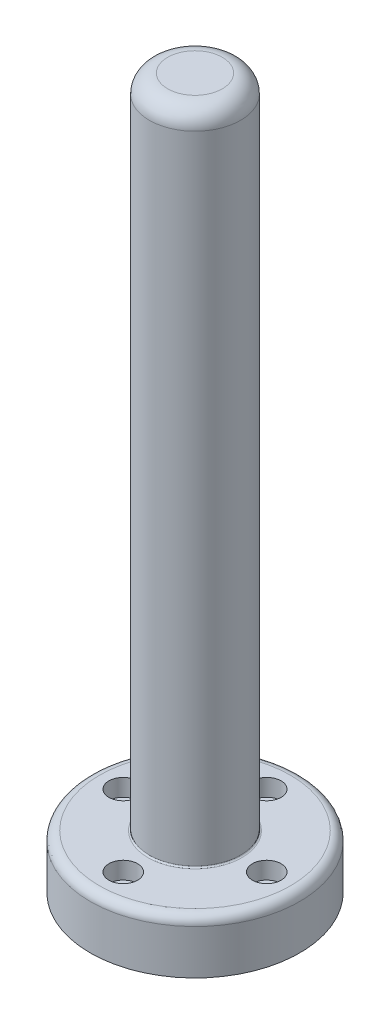
ISO-10303-21;
HEADER;
FILE_DESCRIPTION(('STEP AP214'),'2;1');
FILE_NAME('part.step','',(''),(''),'','','');
FILE_SCHEMA(('AUTOMOTIVE_DESIGN { 1 0 10303 214 1 1 1 1 }'));
ENDSEC;
DATA;
#1=APPLICATION_CONTEXT('core data for automotive mechanical design processes');
#2=APPLICATION_PROTOCOL_DEFINITION('international standard','automotive_design',2000,#1);
#3=PRODUCT_CONTEXT('',#1,'mechanical');
#4=PRODUCT('Part','Part','',(#3));
#5=PRODUCT_RELATED_PRODUCT_CATEGORY('part','',(#4));
#6=PRODUCT_DEFINITION_FORMATION('','',#4);
#7=PRODUCT_DEFINITION_CONTEXT('part definition',#1,'design');
#8=PRODUCT_DEFINITION('design','',#6,#7);
#9=PRODUCT_DEFINITION_SHAPE('','',#8);
#10=(LENGTH_UNIT() NAMED_UNIT(*) SI_UNIT(.MILLI.,.METRE.));
#11=(NAMED_UNIT(*) PLANE_ANGLE_UNIT() SI_UNIT($,.RADIAN.));
#12=(NAMED_UNIT(*) SI_UNIT($,.STERADIAN.) SOLID_ANGLE_UNIT());
#13=UNCERTAINTY_MEASURE_WITH_UNIT(LENGTH_MEASURE(1.E-05),#10,'distance_accuracy_value','');
#14=(GEOMETRIC_REPRESENTATION_CONTEXT(3) GLOBAL_UNCERTAINTY_ASSIGNED_CONTEXT((#13)) GLOBAL_UNIT_ASSIGNED_CONTEXT((#10,
#11,#12)) REPRESENTATION_CONTEXT('',''));
#15=CARTESIAN_POINT('',(0.,0.,0.));
#16=DIRECTION('',(0.,0.,1.));
#17=DIRECTION('',(1.,0.,0.));
#18=AXIS2_PLACEMENT_3D('',#15,#16,#17);
#19=CARTESIAN_POINT('',(-25.,-6.35,-2.66740421992707E-13));
#20=DIRECTION('',(0.,1.,0.));
#21=DIRECTION('',(0.,0.,1.));
#22=AXIS2_PLACEMENT_3D('',#19,#20,#21);
#23=CYLINDRICAL_SURFACE('',#22,3.3);
#24=CARTESIAN_POINT('',(-25.,0.,-2.66740421992707E-13));
#25=DIRECTION('',(0.,1.,0.));
#26=DIRECTION('',(0.,0.,1.));
#27=AXIS2_PLACEMENT_3D('',#24,#25,#26);
#28=CIRCLE('',#27,3.3);
#29=CARTESIAN_POINT('',(-25.,0.,3.29999999999973));
#30=VERTEX_POINT('',#29);
#31=EDGE_CURVE('E81',#30,#30,#28,.T.);
#32=ORIENTED_EDGE('',*,*,#31,.F.);
#33=EDGE_LOOP('',(#32));
#34=FACE_BOUND('',#33,.T.);
#35=CARTESIAN_POINT('',(-25.,6.35,-2.66740421992707E-13));
#36=DIRECTION('',(0.,1.,0.));
#37=DIRECTION('',(0.,0.,1.));
#38=AXIS2_PLACEMENT_3D('',#35,#36,#37);
#39=CIRCLE('',#38,3.3);
#40=CARTESIAN_POINT('',(-25.,6.35,3.29999999999973));
#41=VERTEX_POINT('',#40);
#42=EDGE_CURVE('E91',#41,#41,#39,.F.);
#43=ORIENTED_EDGE('',*,*,#42,.F.);
#44=EDGE_LOOP('',(#43));
#45=FACE_BOUND('',#44,.T.);
#46=ADVANCED_FACE('F38',(#34,#45),#23,.F.);
#47=CARTESIAN_POINT('',(-1.75983941569675E-13,-6.35,25.));
#48=DIRECTION('',(0.,1.,0.));
#49=DIRECTION('',(0.,0.,1.));
#50=AXIS2_PLACEMENT_3D('',#47,#48,#49);
#51=CYLINDRICAL_SURFACE('',#50,3.3);
#52=CARTESIAN_POINT('',(-1.75983941569675E-13,0.,25.));
#53=DIRECTION('',(0.,1.,0.));
#54=DIRECTION('',(0.,0.,1.));
#55=AXIS2_PLACEMENT_3D('',#52,#53,#54);
#56=CIRCLE('',#55,3.3);
#57=CARTESIAN_POINT('',(-1.75983941569675E-13,0.,28.3));
#58=VERTEX_POINT('',#57);
#59=EDGE_CURVE('E118',#58,#58,#56,.T.);
#60=ORIENTED_EDGE('',*,*,#59,.F.);
#61=EDGE_LOOP('',(#60));
#62=FACE_BOUND('',#61,.T.);
#63=CARTESIAN_POINT('',(-1.75983941569675E-13,6.35,25.));
#64=DIRECTION('',(0.,1.,0.));
#65=DIRECTION('',(0.,0.,1.));
#66=AXIS2_PLACEMENT_3D('',#63,#64,#65);
#67=CIRCLE('',#66,3.3);
#68=CARTESIAN_POINT('',(-1.75983941569675E-13,6.35,28.3));
#69=VERTEX_POINT('',#68);
#70=EDGE_CURVE('E94',#69,#69,#67,.F.);
#71=ORIENTED_EDGE('',*,*,#70,.F.);
#72=EDGE_LOOP('',(#71));
#73=FACE_BOUND('',#72,.T.);
#74=ADVANCED_FACE('F155',(#62,#73),#51,.F.);
#75=CARTESIAN_POINT('',(25.,-6.35,0.));
#76=DIRECTION('',(0.,1.,0.));
#77=DIRECTION('',(0.,0.,1.));
#78=AXIS2_PLACEMENT_3D('',#75,#76,#77);
#79=CYLINDRICAL_SURFACE('',#78,3.3);
#80=CARTESIAN_POINT('',(25.,0.,0.));
#81=DIRECTION('',(0.,1.,0.));
#82=DIRECTION('',(0.,0.,1.));
#83=AXIS2_PLACEMENT_3D('',#80,#81,#82);
#84=CIRCLE('',#83,3.3);
#85=CARTESIAN_POINT('',(25.,0.,3.30000000000009));
#86=VERTEX_POINT('',#85);
#87=EDGE_CURVE('E115',#86,#86,#84,.T.);
#88=ORIENTED_EDGE('',*,*,#87,.F.);
#89=EDGE_LOOP('',(#88));
#90=FACE_BOUND('',#89,.T.);
#91=CARTESIAN_POINT('',(25.,6.35,0.));
#92=DIRECTION('',(0.,1.,0.));
#93=DIRECTION('',(0.,0.,1.));
#94=AXIS2_PLACEMENT_3D('',#91,#92,#93);
#95=CIRCLE('',#94,3.3);
#96=CARTESIAN_POINT('',(25.,6.35,3.30000000000009));
#97=VERTEX_POINT('',#96);
#98=EDGE_CURVE('E97',#97,#97,#95,.F.);
#99=ORIENTED_EDGE('',*,*,#98,.F.);
#100=EDGE_LOOP('',(#99));
#101=FACE_BOUND('',#100,.T.);
#102=ADVANCED_FACE('F162',(#90,#101),#79,.F.);
#103=CARTESIAN_POINT('',(0.,-6.35,-25.));
#104=DIRECTION('',(0.,1.,0.));
#105=DIRECTION('',(0.,0.,1.));
#106=AXIS2_PLACEMENT_3D('',#103,#104,#105);
#107=CYLINDRICAL_SURFACE('',#106,3.3);
#108=CARTESIAN_POINT('',(0.,0.,-25.));
#109=DIRECTION('',(0.,1.,0.));
#110=DIRECTION('',(0.,0.,1.));
#111=AXIS2_PLACEMENT_3D('',#108,#109,#110);
#112=CIRCLE('',#111,3.3);
#113=CARTESIAN_POINT('',(0.,0.,-21.7));
#114=VERTEX_POINT('',#113);
#115=EDGE_CURVE('E110',#114,#114,#112,.T.);
#116=ORIENTED_EDGE('',*,*,#115,.F.);
#117=EDGE_LOOP('',(#116));
#118=FACE_BOUND('',#117,.T.);
#119=CARTESIAN_POINT('',(0.,6.35,-25.));
#120=DIRECTION('',(0.,1.,0.));
#121=DIRECTION('',(0.,0.,1.));
#122=AXIS2_PLACEMENT_3D('',#119,#120,#121);
#123=CIRCLE('',#122,3.3);
#124=CARTESIAN_POINT('',(0.,6.35,-21.7));
#125=VERTEX_POINT('',#124);
#126=EDGE_CURVE('E100',#125,#125,#123,.F.);
#127=ORIENTED_EDGE('',*,*,#126,.F.);
#128=EDGE_LOOP('',(#127));
#129=FACE_BOUND('',#128,.T.);
#130=ADVANCED_FACE('F187',(#118,#129),#107,.F.);
#131=CARTESIAN_POINT('',(0.,-6.35,0.));
#132=DIRECTION('',(0.,1.,0.));
#133=DIRECTION('',(0.,0.,1.));
#134=AXIS2_PLACEMENT_3D('',#131,#132,#133);
#135=CYLINDRICAL_SURFACE('',#134,36.5125);
#136=CARTESIAN_POINT('',(0.,9.175,0.));
#137=DIRECTION('',(0.,1.,0.));
#138=DIRECTION('',(0.,0.,1.));
#139=AXIS2_PLACEMENT_3D('',#136,#137,#138);
#140=CIRCLE('',#139,36.5125);
#141=CARTESIAN_POINT('',(0.,9.175,36.5125));
#142=VERTEX_POINT('',#141);
#143=EDGE_CURVE('E65',#142,#142,#140,.F.);
#144=ORIENTED_EDGE('',*,*,#143,.T.);
#145=EDGE_LOOP('',(#144));
#146=FACE_BOUND('',#145,.T.);
#147=CARTESIAN_POINT('',(0.,-6.35,0.));
#148=DIRECTION('',(0.,1.,0.));
#149=DIRECTION('',(0.,0.,1.));
#150=AXIS2_PLACEMENT_3D('',#147,#148,#149);
#151=CIRCLE('',#150,36.5125);
#152=CARTESIAN_POINT('',(0.,-6.35,36.5125));
#153=VERTEX_POINT('',#152);
#154=EDGE_CURVE('E77',#153,#153,#151,.T.);
#155=ORIENTED_EDGE('',*,*,#154,.T.);
#156=EDGE_LOOP('',(#155));
#157=FACE_BOUND('',#156,.T.);
#158=ADVANCED_FACE('F184',(#146,#157),#135,.T.);
#159=CARTESIAN_POINT('',(0.,-6.35,0.));
#160=DIRECTION('',(0.,1.,0.));
#161=DIRECTION('',(0.,0.,1.));
#162=AXIS2_PLACEMENT_3D('',#159,#160,#161);
#163=PLANE('',#162);
#164=CARTESIAN_POINT('',(0.,-6.35,0.));
#165=DIRECTION('',(0.,1.,0.));
#166=DIRECTION('',(0.,0.,1.));
#167=AXIS2_PLACEMENT_3D('',#164,#165,#166);
#168=CIRCLE('',#167,31.75);
#169=CARTESIAN_POINT('',(0.,-6.35,31.75));
#170=VERTEX_POINT('',#169);
#171=EDGE_CURVE('E106',#170,#170,#168,.T.);
#172=ORIENTED_EDGE('',*,*,#171,.T.);
#173=EDGE_LOOP('',(#172));
#174=FACE_BOUND('',#173,.T.);
#175=ORIENTED_EDGE('',*,*,#154,.F.);
#176=EDGE_LOOP('',(#175));
#177=FACE_BOUND('',#176,.T.);
#178=ADVANCED_FACE('F180',(#174,#177),#163,.F.);
#179=CARTESIAN_POINT('',(0.,-6.35,0.));
#180=DIRECTION('',(0.,1.,0.));
#181=DIRECTION('',(0.,0.,1.));
#182=AXIS2_PLACEMENT_3D('',#179,#180,#181);
#183=CYLINDRICAL_SURFACE('',#182,31.75);
#184=ORIENTED_EDGE('',*,*,#171,.F.);
#185=EDGE_LOOP('',(#184));
#186=FACE_BOUND('',#185,.T.);
#187=CARTESIAN_POINT('',(0.,0.,0.));
#188=DIRECTION('',(0.,1.,0.));
#189=DIRECTION('',(0.,0.,1.));
#190=AXIS2_PLACEMENT_3D('',#187,#188,#189);
#191=CIRCLE('',#190,31.75);
#192=CARTESIAN_POINT('',(0.,0.,31.75));
#193=VERTEX_POINT('',#192);
#194=EDGE_CURVE('E107',#193,#193,#191,.T.);
#195=ORIENTED_EDGE('',*,*,#194,.T.);
#196=EDGE_LOOP('',(#195));
#197=FACE_BOUND('',#196,.T.);
#198=ADVANCED_FACE('F176',(#186,#197),#183,.F.);
#199=CARTESIAN_POINT('',(0.,0.,0.));
#200=DIRECTION('',(0.,1.,0.));
#201=DIRECTION('',(0.,0.,1.));
#202=AXIS2_PLACEMENT_3D('',#199,#200,#201);
#203=PLANE('',#202);
#204=ORIENTED_EDGE('',*,*,#115,.T.);
#205=EDGE_LOOP('',(#204));
#206=FACE_BOUND('',#205,.T.);
#207=ORIENTED_EDGE('',*,*,#87,.T.);
#208=EDGE_LOOP('',(#207));
#209=FACE_BOUND('',#208,.T.);
#210=ORIENTED_EDGE('',*,*,#59,.T.);
#211=EDGE_LOOP('',(#210));
#212=FACE_BOUND('',#211,.T.);
#213=ORIENTED_EDGE('',*,*,#31,.T.);
#214=EDGE_LOOP('',(#213));
#215=FACE_BOUND('',#214,.T.);
#216=ORIENTED_EDGE('',*,*,#194,.F.);
#217=EDGE_LOOP('',(#216));
#218=FACE_BOUND('',#217,.T.);
#219=ADVANCED_FACE('F173',(#206,#209,#212,#215,#218),#203,.F.);
#220=CARTESIAN_POINT('',(0.,12.35,0.));
#221=DIRECTION('',(0.,1.,0.));
#222=DIRECTION('',(0.,0.,1.));
#223=AXIS2_PLACEMENT_3D('',#220,#221,#222);
#224=PLANE('',#223);
#225=CARTESIAN_POINT('',(0.,12.35,0.));
#226=DIRECTION('',(0.,1.,0.));
#227=DIRECTION('',(0.,0.,1.));
#228=AXIS2_PLACEMENT_3D('',#225,#226,#227);
#229=CIRCLE('',#228,33.3375);
#230=CARTESIAN_POINT('',(0.,12.35,33.3375));
#231=VERTEX_POINT('',#230);
#232=EDGE_CURVE('E68',#231,#231,#229,.T.);
#233=ORIENTED_EDGE('',*,*,#232,.T.);
#234=EDGE_LOOP('',(#233));
#235=FACE_BOUND('',#234,.T.);
#236=CARTESIAN_POINT('',(0.,12.35,0.));
#237=DIRECTION('',(0.,1.,0.));
#238=DIRECTION('',(0.,0.,1.));
#239=AXIS2_PLACEMENT_3D('',#236,#237,#238);
#240=CIRCLE('',#239,16.383);
#241=CARTESIAN_POINT('',(0.,12.35,16.383));
#242=VERTEX_POINT('',#241);
#243=EDGE_CURVE('E71',#242,#242,#240,.F.);
#244=ORIENTED_EDGE('',*,*,#243,.T.);
#245=EDGE_LOOP('',(#244));
#246=FACE_BOUND('',#245,.T.);
#247=CARTESIAN_POINT('',(-25.,12.35,-2.66740421992707E-13));
#248=DIRECTION('',(0.,1.,0.));
#249=DIRECTION('',(0.,0.,1.));
#250=AXIS2_PLACEMENT_3D('',#247,#248,#249);
#251=CIRCLE('',#250,5.);
#252=CARTESIAN_POINT('',(-25.,12.35,4.99999999999973));
#253=VERTEX_POINT('',#252);
#254=EDGE_CURVE('E78',#253,#253,#251,.F.);
#255=ORIENTED_EDGE('',*,*,#254,.T.);
#256=EDGE_LOOP('',(#255));
#257=FACE_BOUND('',#256,.T.);
#258=CARTESIAN_POINT('',(3.54027455463785E-13,12.35,-25.));
#259=DIRECTION('',(0.,1.,0.));
#260=DIRECTION('',(0.,0.,1.));
#261=AXIS2_PLACEMENT_3D('',#258,#259,#260);
#262=CIRCLE('',#261,5.);
#263=CARTESIAN_POINT('',(3.54027455463785E-13,12.35,-20.));
#264=VERTEX_POINT('',#263);
#265=EDGE_CURVE('E82',#264,#264,#262,.F.);
#266=ORIENTED_EDGE('',*,*,#265,.T.);
#267=EDGE_LOOP('',(#266));
#268=FACE_BOUND('',#267,.T.);
#269=CARTESIAN_POINT('',(25.,12.35,4.41314488934864E-13));
#270=DIRECTION('',(0.,1.,0.));
#271=DIRECTION('',(0.,0.,1.));
#272=AXIS2_PLACEMENT_3D('',#269,#270,#271);
#273=CIRCLE('',#272,5.);
#274=CARTESIAN_POINT('',(25.,12.35,5.00000000000044));
#275=VERTEX_POINT('',#274);
#276=EDGE_CURVE('E85',#275,#275,#273,.F.);
#277=ORIENTED_EDGE('',*,*,#276,.T.);
#278=EDGE_LOOP('',(#277));
#279=FACE_BOUND('',#278,.T.);
#280=CARTESIAN_POINT('',(-5.28601522405942E-13,12.35,25.));
#281=DIRECTION('',(0.,1.,0.));
#282=DIRECTION('',(0.,0.,1.));
#283=AXIS2_PLACEMENT_3D('',#280,#281,#282);
#284=CIRCLE('',#283,5.);
#285=CARTESIAN_POINT('',(-5.28601522405942E-13,12.35,30.));
#286=VERTEX_POINT('',#285);
#287=EDGE_CURVE('E88',#286,#286,#284,.F.);
#288=ORIENTED_EDGE('',*,*,#287,.T.);
#289=EDGE_LOOP('',(#288));
#290=FACE_BOUND('',#289,.T.);
#291=ADVANCED_FACE('F169',(#235,#246,#257,#268,#279,#290),#224,.T.);
#292=CARTESIAN_POINT('',(0.,240.95,0.));
#293=DIRECTION('',(0.,-1.,0.));
#294=DIRECTION('',(0.,0.,-1.));
#295=AXIS2_PLACEMENT_3D('',#292,#293,#294);
#296=CYLINDRICAL_SURFACE('',#295,15.875);
#297=CARTESIAN_POINT('',(0.,234.6,0.));
#298=DIRECTION('',(0.,1.,0.));
#299=DIRECTION('',(0.,0.,1.));
#300=AXIS2_PLACEMENT_3D('',#297,#298,#299);
#301=CIRCLE('',#300,15.875);
#302=CARTESIAN_POINT('',(0.,234.6,15.875));
#303=VERTEX_POINT('',#302);
#304=EDGE_CURVE('E50',#303,#303,#301,.F.);
#305=ORIENTED_EDGE('',*,*,#304,.T.);
#306=EDGE_LOOP('',(#305));
#307=FACE_BOUND('',#306,.T.);
#308=CARTESIAN_POINT('',(0.,12.858,0.));
#309=DIRECTION('',(0.,1.,0.));
#310=DIRECTION('',(0.,0.,1.));
#311=AXIS2_PLACEMENT_3D('',#308,#309,#310);
#312=CIRCLE('',#311,15.875);
#313=CARTESIAN_POINT('',(0.,12.858,15.875));
#314=VERTEX_POINT('',#313);
#315=EDGE_CURVE('E74',#314,#314,#312,.T.);
#316=ORIENTED_EDGE('',*,*,#315,.T.);
#317=EDGE_LOOP('',(#316));
#318=FACE_BOUND('',#317,.T.);
#319=ADVANCED_FACE('F172',(#307,#318),#296,.T.);
#320=CARTESIAN_POINT('',(0.,240.95,0.));
#321=DIRECTION('',(0.,1.,0.));
#322=DIRECTION('',(0.,0.,1.));
#323=AXIS2_PLACEMENT_3D('',#320,#321,#322);
#324=PLANE('',#323);
#325=CARTESIAN_POINT('',(0.,240.95,0.));
#326=DIRECTION('',(0.,1.,0.));
#327=DIRECTION('',(0.,0.,1.));
#328=AXIS2_PLACEMENT_3D('',#325,#326,#327);
#329=CIRCLE('',#328,9.525);
#330=CARTESIAN_POINT('',(0.,240.95,9.525));
#331=VERTEX_POINT('',#330);
#332=EDGE_CURVE('E54',#331,#331,#329,.T.);
#333=ORIENTED_EDGE('',*,*,#332,.T.);
#334=EDGE_LOOP('',(#333));
#335=FACE_BOUND('',#334,.T.);
#336=ADVANCED_FACE('F210',(#335),#324,.T.);
#337=CARTESIAN_POINT('',(3.54027455463785E-13,6.35,-25.));
#338=DIRECTION('',(0.,1.,0.));
#339=DIRECTION('',(0.,0.,1.));
#340=AXIS2_PLACEMENT_3D('',#337,#338,#339);
#341=PLANE('',#340);
#342=CARTESIAN_POINT('',(3.54027455463785E-13,6.35,-25.));
#343=DIRECTION('',(0.,1.,0.));
#344=DIRECTION('',(0.,0.,1.));
#345=AXIS2_PLACEMENT_3D('',#342,#343,#344);
#346=CIRCLE('',#345,5.);
#347=CARTESIAN_POINT('',(3.54027455463785E-13,6.35,-20.));
#348=VERTEX_POINT('',#347);
#349=EDGE_CURVE('E129',#348,#348,#346,.T.);
#350=ORIENTED_EDGE('',*,*,#349,.T.);
#351=EDGE_LOOP('',(#350));
#352=FACE_BOUND('',#351,.T.);
#353=ORIENTED_EDGE('',*,*,#126,.T.);
#354=EDGE_LOOP('',(#353));
#355=FACE_BOUND('',#354,.T.);
#356=ADVANCED_FACE('F211',(#352,#355),#341,.T.);
#357=CARTESIAN_POINT('',(3.54027455463785E-13,240.95,-25.));
#358=DIRECTION('',(0.,-1.,0.));
#359=DIRECTION('',(0.,0.,-1.));
#360=AXIS2_PLACEMENT_3D('',#357,#358,#359);
#361=CYLINDRICAL_SURFACE('',#360,5.);
#362=ORIENTED_EDGE('',*,*,#265,.F.);
#363=EDGE_LOOP('',(#362));
#364=FACE_BOUND('',#363,.T.);
#365=ORIENTED_EDGE('',*,*,#349,.F.);
#366=EDGE_LOOP('',(#365));
#367=FACE_BOUND('',#366,.T.);
#368=ADVANCED_FACE('F217',(#364,#367),#361,.F.);
#369=CARTESIAN_POINT('',(25.,6.35,4.41314488934864E-13));
#370=DIRECTION('',(0.,1.,0.));
#371=DIRECTION('',(0.,0.,1.));
#372=AXIS2_PLACEMENT_3D('',#369,#370,#371);
#373=PLANE('',#372);
#374=CARTESIAN_POINT('',(25.,6.35,4.41314488934864E-13));
#375=DIRECTION('',(0.,1.,0.));
#376=DIRECTION('',(0.,0.,1.));
#377=AXIS2_PLACEMENT_3D('',#374,#375,#376);
#378=CIRCLE('',#377,5.);
#379=CARTESIAN_POINT('',(25.,6.35,5.00000000000044));
#380=VERTEX_POINT('',#379);
#381=EDGE_CURVE('E126',#380,#380,#378,.T.);
#382=ORIENTED_EDGE('',*,*,#381,.T.);
#383=EDGE_LOOP('',(#382));
#384=FACE_BOUND('',#383,.T.);
#385=ORIENTED_EDGE('',*,*,#98,.T.);
#386=EDGE_LOOP('',(#385));
#387=FACE_BOUND('',#386,.T.);
#388=ADVANCED_FACE('F236',(#384,#387),#373,.T.);
#389=CARTESIAN_POINT('',(25.,240.95,4.41314488934864E-13));
#390=DIRECTION('',(0.,-1.,0.));
#391=DIRECTION('',(0.,0.,-1.));
#392=AXIS2_PLACEMENT_3D('',#389,#390,#391);
#393=CYLINDRICAL_SURFACE('',#392,5.);
#394=ORIENTED_EDGE('',*,*,#276,.F.);
#395=EDGE_LOOP('',(#394));
#396=FACE_BOUND('',#395,.T.);
#397=ORIENTED_EDGE('',*,*,#381,.F.);
#398=EDGE_LOOP('',(#397));
#399=FACE_BOUND('',#398,.T.);
#400=ADVANCED_FACE('F238',(#396,#399),#393,.F.);
#401=CARTESIAN_POINT('',(-5.28601522405942E-13,6.35,25.));
#402=DIRECTION('',(0.,1.,0.));
#403=DIRECTION('',(0.,0.,1.));
#404=AXIS2_PLACEMENT_3D('',#401,#402,#403);
#405=PLANE('',#404);
#406=CARTESIAN_POINT('',(-5.28601522405942E-13,6.35,25.));
#407=DIRECTION('',(0.,1.,0.));
#408=DIRECTION('',(0.,0.,1.));
#409=AXIS2_PLACEMENT_3D('',#406,#407,#408);
#410=CIRCLE('',#409,5.);
#411=CARTESIAN_POINT('',(-5.28601522405942E-13,6.35,30.));
#412=VERTEX_POINT('',#411);
#413=EDGE_CURVE('E123',#412,#412,#410,.T.);
#414=ORIENTED_EDGE('',*,*,#413,.T.);
#415=EDGE_LOOP('',(#414));
#416=FACE_BOUND('',#415,.T.);
#417=ORIENTED_EDGE('',*,*,#70,.T.);
#418=EDGE_LOOP('',(#417));
#419=FACE_BOUND('',#418,.T.);
#420=ADVANCED_FACE('F223',(#416,#419),#405,.T.);
#421=CARTESIAN_POINT('',(-5.28601522405942E-13,240.95,25.));
#422=DIRECTION('',(0.,-1.,0.));
#423=DIRECTION('',(0.,0.,-1.));
#424=AXIS2_PLACEMENT_3D('',#421,#422,#423);
#425=CYLINDRICAL_SURFACE('',#424,5.);
#426=ORIENTED_EDGE('',*,*,#287,.F.);
#427=EDGE_LOOP('',(#426));
#428=FACE_BOUND('',#427,.T.);
#429=ORIENTED_EDGE('',*,*,#413,.F.);
#430=EDGE_LOOP('',(#429));
#431=FACE_BOUND('',#430,.T.);
#432=ADVANCED_FACE('F150',(#428,#431),#425,.F.);
#433=CARTESIAN_POINT('',(-25.,6.35,-2.66740421992707E-13));
#434=DIRECTION('',(0.,1.,0.));
#435=DIRECTION('',(0.,0.,1.));
#436=AXIS2_PLACEMENT_3D('',#433,#434,#435);
#437=PLANE('',#436);
#438=CARTESIAN_POINT('',(-25.,6.35,-2.66740421992707E-13));
#439=DIRECTION('',(0.,1.,0.));
#440=DIRECTION('',(0.,0.,1.));
#441=AXIS2_PLACEMENT_3D('',#438,#439,#440);
#442=CIRCLE('',#441,5.);
#443=CARTESIAN_POINT('',(-25.,6.35,4.99999999999973));
#444=VERTEX_POINT('',#443);
#445=EDGE_CURVE('E103',#444,#444,#442,.T.);
#446=ORIENTED_EDGE('',*,*,#445,.T.);
#447=EDGE_LOOP('',(#446));
#448=FACE_BOUND('',#447,.T.);
#449=ORIENTED_EDGE('',*,*,#42,.T.);
#450=EDGE_LOOP('',(#449));
#451=FACE_BOUND('',#450,.T.);
#452=ADVANCED_FACE('F135',(#448,#451),#437,.T.);
#453=CARTESIAN_POINT('',(-25.,240.95,-2.66740421992707E-13));
#454=DIRECTION('',(0.,-1.,0.));
#455=DIRECTION('',(0.,0.,-1.));
#456=AXIS2_PLACEMENT_3D('',#453,#454,#455);
#457=CYLINDRICAL_SURFACE('',#456,5.);
#458=ORIENTED_EDGE('',*,*,#254,.F.);
#459=EDGE_LOOP('',(#458));
#460=FACE_BOUND('',#459,.T.);
#461=ORIENTED_EDGE('',*,*,#445,.F.);
#462=EDGE_LOOP('',(#461));
#463=FACE_BOUND('',#462,.T.);
#464=ADVANCED_FACE('F138',(#460,#463),#457,.F.);
#465=CARTESIAN_POINT('',(0.,12.858,0.));
#466=DIRECTION('',(0.,1.,0.));
#467=DIRECTION('',(0.,0.,1.));
#468=AXIS2_PLACEMENT_3D('',#465,#466,#467);
#469=TOROIDAL_SURFACE('',#468,16.383,0.508);
#470=ORIENTED_EDGE('',*,*,#243,.F.);
#471=EDGE_LOOP('',(#470));
#472=FACE_BOUND('',#471,.T.);
#473=ORIENTED_EDGE('',*,*,#315,.F.);
#474=EDGE_LOOP('',(#473));
#475=FACE_BOUND('',#474,.T.);
#476=ADVANCED_FACE('F140',(#472,#475),#469,.F.);
#477=CARTESIAN_POINT('',(0.,9.175,0.));
#478=DIRECTION('',(0.,1.,0.));
#479=DIRECTION('',(0.,0.,1.));
#480=AXIS2_PLACEMENT_3D('',#477,#478,#479);
#481=TOROIDAL_SURFACE('',#480,33.3375,3.175);
#482=ORIENTED_EDGE('',*,*,#143,.F.);
#483=EDGE_LOOP('',(#482));
#484=FACE_BOUND('',#483,.T.);
#485=ORIENTED_EDGE('',*,*,#232,.F.);
#486=EDGE_LOOP('',(#485));
#487=FACE_BOUND('',#486,.T.);
#488=ADVANCED_FACE('F147',(#484,#487),#481,.T.);
#489=CARTESIAN_POINT('',(0.,234.6,0.));
#490=DIRECTION('',(0.,1.,0.));
#491=DIRECTION('',(0.,0.,1.));
#492=AXIS2_PLACEMENT_3D('',#489,#490,#491);
#493=TOROIDAL_SURFACE('',#492,9.525,6.35);
#494=ORIENTED_EDGE('',*,*,#304,.F.);
#495=EDGE_LOOP('',(#494));
#496=FACE_BOUND('',#495,.T.);
#497=ORIENTED_EDGE('',*,*,#332,.F.);
#498=EDGE_LOOP('',(#497));
#499=FACE_BOUND('',#498,.T.);
#500=ADVANCED_FACE('F192',(#496,#499),#493,.T.);
#501=CLOSED_SHELL('',(#46,#74,#102,#130,#158,#178,#198,#219,#291,#319,#336,#356,#368,#388,#400,
#420,#432,#452,#464,#476,#488,#500));
#502=CARTESIAN_POINT('',(0.,234.6,0.));
#503=DIRECTION('',(0.,1.,0.));
#504=DIRECTION('',(0.,0.,1.));
#505=AXIS2_PLACEMENT_3D('',#502,#503,#504);
#506=PLANE('',#505);
#507=CARTESIAN_POINT('',(0.,234.6,0.));
#508=DIRECTION('',(0.,1.,0.));
#509=DIRECTION('',(0.,0.,1.));
#510=AXIS2_PLACEMENT_3D('',#507,#508,#509);
#511=CIRCLE('',#510,3.175);
#512=CARTESIAN_POINT('',(0.,234.6,3.175));
#513=VERTEX_POINT('',#512);
#514=EDGE_CURVE('E46',#513,#513,#511,.F.);
#515=ORIENTED_EDGE('',*,*,#514,.T.);
#516=EDGE_LOOP('',(#515));
#517=FACE_BOUND('',#516,.T.);
#518=ADVANCED_FACE('F376',(#517),#506,.F.);
#519=CARTESIAN_POINT('',(0.,18.7,0.));
#520=DIRECTION('',(0.,1.,0.));
#521=DIRECTION('',(0.,0.,1.));
#522=AXIS2_PLACEMENT_3D('',#519,#520,#521);
#523=PLANE('',#522);
#524=CARTESIAN_POINT('',(0.,18.7,0.));
#525=DIRECTION('',(0.,1.,0.));
#526=DIRECTION('',(0.,0.,1.));
#527=AXIS2_PLACEMENT_3D('',#524,#525,#526);
#528=CIRCLE('',#527,3.175);
#529=CARTESIAN_POINT('',(0.,18.7,3.175));
#530=VERTEX_POINT('',#529);
#531=EDGE_CURVE('E62',#530,#530,#528,.T.);
#532=ORIENTED_EDGE('',*,*,#531,.T.);
#533=EDGE_LOOP('',(#532));
#534=FACE_BOUND('',#533,.T.);
#535=ADVANCED_FACE('F197',(#534),#523,.T.);
#536=CARTESIAN_POINT('',(0.,25.05,0.));
#537=DIRECTION('',(0.,1.,0.));
#538=DIRECTION('',(0.,0.,1.));
#539=AXIS2_PLACEMENT_3D('',#536,#537,#538);
#540=DEGENERATE_TOROIDAL_SURFACE('',#539,3.175,6.35,.T.);
#541=CARTESIAN_POINT('',(0.,25.05,0.));
#542=DIRECTION('',(0.,1.,0.));
#543=DIRECTION('',(0.,0.,1.));
#544=AXIS2_PLACEMENT_3D('',#541,#542,#543);
#545=CIRCLE('',#544,9.525);
#546=CARTESIAN_POINT('',(0.,25.05,9.525));
#547=VERTEX_POINT('',#546);
#548=EDGE_CURVE('E59',#547,#547,#545,.F.);
#549=ORIENTED_EDGE('',*,*,#548,.F.);
#550=EDGE_LOOP('',(#549));
#551=FACE_BOUND('',#550,.T.);
#552=ORIENTED_EDGE('',*,*,#531,.F.);
#553=EDGE_LOOP('',(#552));
#554=FACE_BOUND('',#553,.T.);
#555=ADVANCED_FACE('F194',(#551,#554),#540,.F.);
#556=CARTESIAN_POINT('',(0.,18.7,0.));
#557=DIRECTION('',(0.,1.,0.));
#558=DIRECTION('',(0.,0.,1.));
#559=AXIS2_PLACEMENT_3D('',#556,#557,#558);
#560=CYLINDRICAL_SURFACE('',#559,9.525);
#561=CARTESIAN_POINT('',(0.,228.25,0.));
#562=DIRECTION('',(0.,1.,0.));
#563=DIRECTION('',(0.,0.,1.));
#564=AXIS2_PLACEMENT_3D('',#561,#562,#563);
#565=CIRCLE('',#564,9.525);
#566=CARTESIAN_POINT('',(0.,228.25,9.525));
#567=VERTEX_POINT('',#566);
#568=EDGE_CURVE('E10',#567,#567,#565,.T.);
#569=ORIENTED_EDGE('',*,*,#568,.T.);
#570=EDGE_LOOP('',(#569));
#571=FACE_BOUND('',#570,.T.);
#572=ORIENTED_EDGE('',*,*,#548,.T.);
#573=EDGE_LOOP('',(#572));
#574=FACE_BOUND('',#573,.T.);
#575=ADVANCED_FACE('F196',(#571,#574),#560,.F.);
#576=CARTESIAN_POINT('',(0.,228.25,0.));
#577=DIRECTION('',(0.,1.,0.));
#578=DIRECTION('',(0.,0.,1.));
#579=AXIS2_PLACEMENT_3D('',#576,#577,#578);
#580=DEGENERATE_TOROIDAL_SURFACE('',#579,3.175,6.35,.T.);
#581=ORIENTED_EDGE('',*,*,#568,.F.);
#582=EDGE_LOOP('',(#581));
#583=FACE_BOUND('',#582,.T.);
#584=ORIENTED_EDGE('',*,*,#514,.F.);
#585=EDGE_LOOP('',(#584));
#586=FACE_BOUND('',#585,.T.);
#587=ADVANCED_FACE('F40',(#583,#586),#580,.F.);
#588=CLOSED_SHELL('',(#518,#535,#555,#575,#587));
#589=ORIENTED_CLOSED_SHELL('',*,#588,.T.);
#590=BREP_WITH_VOIDS('B2',#501,(#589));
#591=ADVANCED_BREP_SHAPE_REPRESENTATION('',(#18,#590),#14);
#592=SHAPE_DEFINITION_REPRESENTATION(#9,#591);
ENDSEC;
END-ISO-10303-21;
